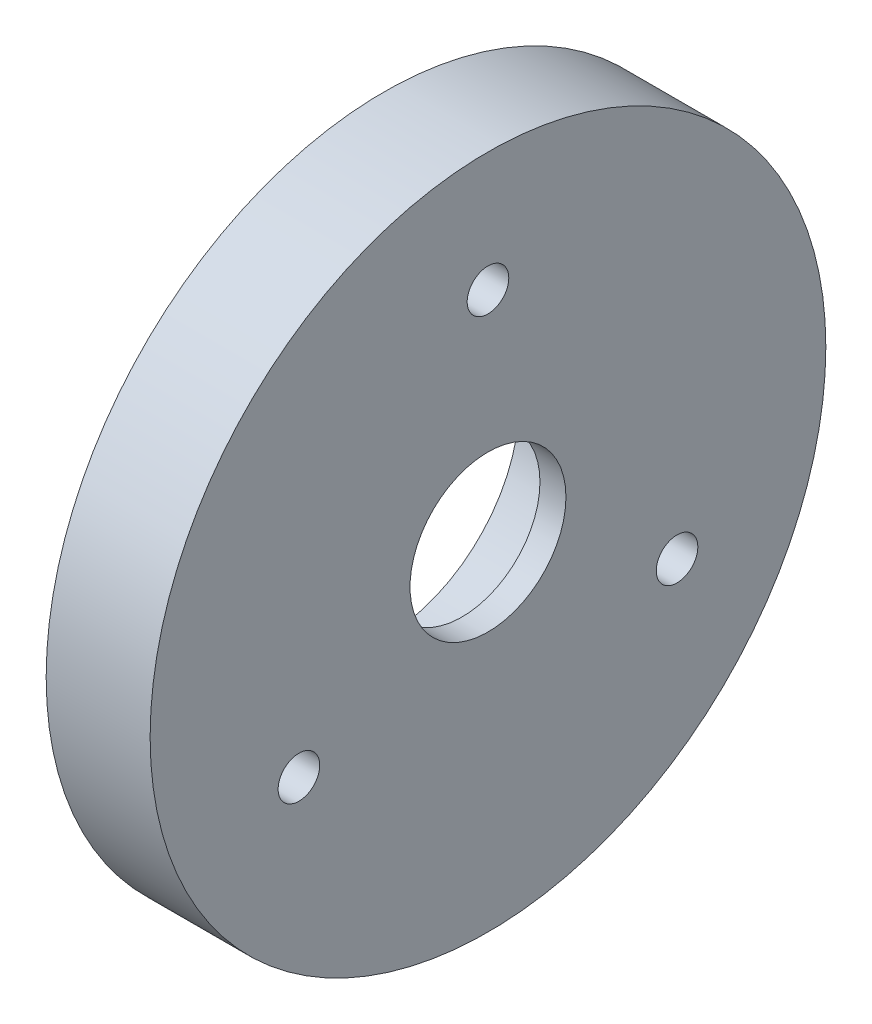
ISO-10303-21;
HEADER;
FILE_DESCRIPTION(('STEP AP214'),'2;1');
FILE_NAME('part.step','',(''),(''),'','','');
FILE_SCHEMA(('AUTOMOTIVE_DESIGN { 1 0 10303 214 1 1 1 1 }'));
ENDSEC;
DATA;
#1=APPLICATION_CONTEXT('core data for automotive mechanical design processes');
#2=APPLICATION_PROTOCOL_DEFINITION('international standard','automotive_design',2000,#1);
#3=PRODUCT_CONTEXT('',#1,'mechanical');
#4=PRODUCT('Part','Part','',(#3));
#5=PRODUCT_RELATED_PRODUCT_CATEGORY('part','',(#4));
#6=PRODUCT_DEFINITION_FORMATION('','',#4);
#7=PRODUCT_DEFINITION_CONTEXT('part definition',#1,'design');
#8=PRODUCT_DEFINITION('design','',#6,#7);
#9=PRODUCT_DEFINITION_SHAPE('','',#8);
#10=(LENGTH_UNIT() NAMED_UNIT(*) SI_UNIT(.MILLI.,.METRE.));
#11=(NAMED_UNIT(*) PLANE_ANGLE_UNIT() SI_UNIT($,.RADIAN.));
#12=(NAMED_UNIT(*) SI_UNIT($,.STERADIAN.) SOLID_ANGLE_UNIT());
#13=UNCERTAINTY_MEASURE_WITH_UNIT(LENGTH_MEASURE(1.E-05),#10,'distance_accuracy_value','');
#14=(GEOMETRIC_REPRESENTATION_CONTEXT(3) GLOBAL_UNCERTAINTY_ASSIGNED_CONTEXT((#13)) GLOBAL_UNIT_ASSIGNED_CONTEXT((#10,
#11,#12)) REPRESENTATION_CONTEXT('',''));
#15=CARTESIAN_POINT('',(0.,0.,0.));
#16=DIRECTION('',(0.,0.,1.));
#17=DIRECTION('',(1.,0.,0.));
#18=AXIS2_PLACEMENT_3D('',#15,#16,#17);
#19=CARTESIAN_POINT('',(20.,0.,0.));
#20=DIRECTION('',(-1.,0.,0.));
#21=DIRECTION('',(0.,0.,1.));
#22=AXIS2_PLACEMENT_3D('',#19,#20,#21);
#23=CYLINDRICAL_SURFACE('',#22,65.);
#24=CARTESIAN_POINT('',(20.,0.,0.));
#25=DIRECTION('',(1.,0.,0.));
#26=DIRECTION('',(0.,0.,-1.));
#27=AXIS2_PLACEMENT_3D('',#24,#25,#26);
#28=CIRCLE('',#27,65.);
#29=CARTESIAN_POINT('',(20.,0.,-65.));
#30=VERTEX_POINT('',#29);
#31=EDGE_CURVE('E10',#30,#30,#28,.T.);
#32=ORIENTED_EDGE('',*,*,#31,.F.);
#33=EDGE_LOOP('',(#32));
#34=FACE_BOUND('',#33,.T.);
#35=CARTESIAN_POINT('',(0.,0.,0.));
#36=DIRECTION('',(1.,0.,0.));
#37=DIRECTION('',(0.,0.,-1.));
#38=AXIS2_PLACEMENT_3D('',#35,#36,#37);
#39=CIRCLE('',#38,65.);
#40=CARTESIAN_POINT('',(0.,0.,-65.));
#41=VERTEX_POINT('',#40);
#42=EDGE_CURVE('E39',#41,#41,#39,.T.);
#43=ORIENTED_EDGE('',*,*,#42,.T.);
#44=EDGE_LOOP('',(#43));
#45=FACE_BOUND('',#44,.T.);
#46=ADVANCED_FACE('F32',(#34,#45),#23,.T.);
#47=CARTESIAN_POINT('',(20.,0.,0.));
#48=DIRECTION('',(1.,0.,0.));
#49=DIRECTION('',(0.,0.,-1.));
#50=AXIS2_PLACEMENT_3D('',#47,#48,#49);
#51=PLANE('',#50);
#52=CARTESIAN_POINT('',(20.,-21.0000000000002,36.3730669589463));
#53=DIRECTION('',(1.,0.,0.));
#54=DIRECTION('',(0.,0.866025403784436,0.500000000000004));
#55=AXIS2_PLACEMENT_3D('',#52,#53,#54);
#56=CIRCLE('',#55,4.);
#57=CARTESIAN_POINT('',(20.,-17.5358983848624,38.3730669589464));
#58=VERTEX_POINT('',#57);
#59=EDGE_CURVE('E64',#58,#58,#56,.F.);
#60=ORIENTED_EDGE('',*,*,#59,.T.);
#61=EDGE_LOOP('',(#60));
#62=FACE_BOUND('',#61,.T.);
#63=CARTESIAN_POINT('',(20.,-20.9999999999997,-36.3730669589466));
#64=DIRECTION('',(1.,0.,0.));
#65=DIRECTION('',(0.,-0.866025403784443,0.499999999999992));
#66=AXIS2_PLACEMENT_3D('',#63,#64,#65);
#67=CIRCLE('',#66,4.);
#68=CARTESIAN_POINT('',(20.,-24.4641016151374,-34.3730669589467));
#69=VERTEX_POINT('',#68);
#70=EDGE_CURVE('E65',#69,#69,#67,.F.);
#71=ORIENTED_EDGE('',*,*,#70,.T.);
#72=EDGE_LOOP('',(#71));
#73=FACE_BOUND('',#72,.T.);
#74=CARTESIAN_POINT('',(20.,42.,0.));
#75=DIRECTION('',(1.,0.,0.));
#76=DIRECTION('',(0.,0.,-1.));
#77=AXIS2_PLACEMENT_3D('',#74,#75,#76);
#78=CIRCLE('',#77,4.);
#79=CARTESIAN_POINT('',(20.,42.,-4.));
#80=VERTEX_POINT('',#79);
#81=EDGE_CURVE('E54',#80,#80,#78,.F.);
#82=ORIENTED_EDGE('',*,*,#81,.T.);
#83=EDGE_LOOP('',(#82));
#84=FACE_BOUND('',#83,.T.);
#85=CARTESIAN_POINT('',(20.,0.,0.));
#86=DIRECTION('',(1.,0.,0.));
#87=DIRECTION('',(0.,0.,-1.));
#88=AXIS2_PLACEMENT_3D('',#85,#86,#87);
#89=CIRCLE('',#88,15.);
#90=CARTESIAN_POINT('',(20.,0.,-15.));
#91=VERTEX_POINT('',#90);
#92=EDGE_CURVE('E51',#91,#91,#89,.T.);
#93=ORIENTED_EDGE('',*,*,#92,.F.);
#94=EDGE_LOOP('',(#93));
#95=FACE_BOUND('',#94,.T.);
#96=ORIENTED_EDGE('',*,*,#31,.T.);
#97=EDGE_LOOP('',(#96));
#98=FACE_BOUND('',#97,.T.);
#99=ADVANCED_FACE('F73',(#62,#73,#84,#95,#98),#51,.T.);
#100=CARTESIAN_POINT('',(0.,0.,0.));
#101=DIRECTION('',(1.,0.,0.));
#102=DIRECTION('',(0.,0.,-1.));
#103=AXIS2_PLACEMENT_3D('',#100,#101,#102);
#104=PLANE('',#103);
#105=CARTESIAN_POINT('',(0.,-21.0000000000002,36.3730669589463));
#106=DIRECTION('',(1.,0.,0.));
#107=DIRECTION('',(0.,0.866025403784436,0.500000000000004));
#108=AXIS2_PLACEMENT_3D('',#105,#106,#107);
#109=CIRCLE('',#108,4.);
#110=CARTESIAN_POINT('',(0.,-17.5358983848624,38.3730669589464));
#111=VERTEX_POINT('',#110);
#112=EDGE_CURVE('E60',#111,#111,#109,.F.);
#113=ORIENTED_EDGE('',*,*,#112,.F.);
#114=EDGE_LOOP('',(#113));
#115=FACE_BOUND('',#114,.T.);
#116=CARTESIAN_POINT('',(0.,-20.9999999999997,-36.3730669589466));
#117=DIRECTION('',(1.,0.,0.));
#118=DIRECTION('',(0.,-0.866025403784443,0.499999999999992));
#119=AXIS2_PLACEMENT_3D('',#116,#117,#118);
#120=CIRCLE('',#119,4.);
#121=CARTESIAN_POINT('',(0.,-24.4641016151374,-34.3730669589467));
#122=VERTEX_POINT('',#121);
#123=EDGE_CURVE('E61',#122,#122,#120,.F.);
#124=ORIENTED_EDGE('',*,*,#123,.F.);
#125=EDGE_LOOP('',(#124));
#126=FACE_BOUND('',#125,.T.);
#127=CARTESIAN_POINT('',(0.,42.,0.));
#128=DIRECTION('',(1.,0.,0.));
#129=DIRECTION('',(0.,0.,-1.));
#130=AXIS2_PLACEMENT_3D('',#127,#128,#129);
#131=CIRCLE('',#130,4.);
#132=CARTESIAN_POINT('',(0.,42.,-4.));
#133=VERTEX_POINT('',#132);
#134=EDGE_CURVE('E57',#133,#133,#131,.F.);
#135=ORIENTED_EDGE('',*,*,#134,.F.);
#136=EDGE_LOOP('',(#135));
#137=FACE_BOUND('',#136,.T.);
#138=CARTESIAN_POINT('',(0.,0.,0.));
#139=DIRECTION('',(1.,0.,0.));
#140=DIRECTION('',(0.,0.,-1.));
#141=AXIS2_PLACEMENT_3D('',#138,#139,#140);
#142=CIRCLE('',#141,26.);
#143=CARTESIAN_POINT('',(0.,0.,-26.));
#144=VERTEX_POINT('',#143);
#145=EDGE_CURVE('E46',#144,#144,#142,.T.);
#146=ORIENTED_EDGE('',*,*,#145,.T.);
#147=EDGE_LOOP('',(#146));
#148=FACE_BOUND('',#147,.T.);
#149=ORIENTED_EDGE('',*,*,#42,.F.);
#150=EDGE_LOOP('',(#149));
#151=FACE_BOUND('',#150,.T.);
#152=ADVANCED_FACE('F83',(#115,#126,#137,#148,#151),#104,.F.);
#153=CARTESIAN_POINT('',(15.,0.,0.));
#154=DIRECTION('',(-1.,0.,0.));
#155=DIRECTION('',(0.,0.,1.));
#156=AXIS2_PLACEMENT_3D('',#153,#154,#155);
#157=CYLINDRICAL_SURFACE('',#156,26.);
#158=CARTESIAN_POINT('',(15.,0.,0.));
#159=DIRECTION('',(1.,0.,0.));
#160=DIRECTION('',(0.,0.,-1.));
#161=AXIS2_PLACEMENT_3D('',#158,#159,#160);
#162=CIRCLE('',#161,26.);
#163=CARTESIAN_POINT('',(15.,0.,-26.));
#164=VERTEX_POINT('',#163);
#165=EDGE_CURVE('E44',#164,#164,#162,.T.);
#166=ORIENTED_EDGE('',*,*,#165,.T.);
#167=EDGE_LOOP('',(#166));
#168=FACE_BOUND('',#167,.T.);
#169=ORIENTED_EDGE('',*,*,#145,.F.);
#170=EDGE_LOOP('',(#169));
#171=FACE_BOUND('',#170,.T.);
#172=ADVANCED_FACE('F86',(#168,#171),#157,.F.);
#173=CARTESIAN_POINT('',(15.,0.,0.));
#174=DIRECTION('',(1.,0.,0.));
#175=DIRECTION('',(0.,0.,-1.));
#176=AXIS2_PLACEMENT_3D('',#173,#174,#175);
#177=PLANE('',#176);
#178=CARTESIAN_POINT('',(15.,0.,0.));
#179=DIRECTION('',(1.,0.,0.));
#180=DIRECTION('',(0.,0.,-1.));
#181=AXIS2_PLACEMENT_3D('',#178,#179,#180);
#182=CIRCLE('',#181,15.);
#183=CARTESIAN_POINT('',(15.,0.,-15.));
#184=VERTEX_POINT('',#183);
#185=EDGE_CURVE('E35',#184,#184,#182,.T.);
#186=ORIENTED_EDGE('',*,*,#185,.T.);
#187=EDGE_LOOP('',(#186));
#188=FACE_BOUND('',#187,.T.);
#189=ORIENTED_EDGE('',*,*,#165,.F.);
#190=EDGE_LOOP('',(#189));
#191=FACE_BOUND('',#190,.T.);
#192=ADVANCED_FACE('F106',(#188,#191),#177,.F.);
#193=CARTESIAN_POINT('',(0.,0.,0.));
#194=DIRECTION('',(1.,0.,0.));
#195=DIRECTION('',(0.,0.,-1.));
#196=AXIS2_PLACEMENT_3D('',#193,#194,#195);
#197=CYLINDRICAL_SURFACE('',#196,15.);
#198=ORIENTED_EDGE('',*,*,#92,.T.);
#199=EDGE_LOOP('',(#198));
#200=FACE_BOUND('',#199,.T.);
#201=ORIENTED_EDGE('',*,*,#185,.F.);
#202=EDGE_LOOP('',(#201));
#203=FACE_BOUND('',#202,.T.);
#204=ADVANCED_FACE('F110',(#200,#203),#197,.F.);
#205=CARTESIAN_POINT('',(20.000012,42.,0.));
#206=DIRECTION('',(-1.,0.,0.));
#207=DIRECTION('',(0.,0.,1.));
#208=AXIS2_PLACEMENT_3D('',#205,#206,#207);
#209=CYLINDRICAL_SURFACE('',#208,4.);
#210=ORIENTED_EDGE('',*,*,#81,.F.);
#211=EDGE_LOOP('',(#210));
#212=FACE_BOUND('',#211,.T.);
#213=ORIENTED_EDGE('',*,*,#134,.T.);
#214=EDGE_LOOP('',(#213));
#215=FACE_BOUND('',#214,.T.);
#216=ADVANCED_FACE('F114',(#212,#215),#209,.F.);
#217=CARTESIAN_POINT('',(20.000012,-20.9999999999997,-36.3730669589466));
#218=DIRECTION('',(-1.,0.,0.));
#219=DIRECTION('',(0.,0.866025403784443,-0.499999999999992));
#220=AXIS2_PLACEMENT_3D('',#217,#218,#219);
#221=CYLINDRICAL_SURFACE('',#220,4.);
#222=ORIENTED_EDGE('',*,*,#70,.F.);
#223=EDGE_LOOP('',(#222));
#224=FACE_BOUND('',#223,.T.);
#225=ORIENTED_EDGE('',*,*,#123,.T.);
#226=EDGE_LOOP('',(#225));
#227=FACE_BOUND('',#226,.T.);
#228=ADVANCED_FACE('F79',(#224,#227),#221,.F.);
#229=CARTESIAN_POINT('',(20.000012,-21.0000000000002,36.3730669589463));
#230=DIRECTION('',(-1.,0.,0.));
#231=DIRECTION('',(0.,-0.866025403784436,-0.500000000000004));
#232=AXIS2_PLACEMENT_3D('',#229,#230,#231);
#233=CYLINDRICAL_SURFACE('',#232,4.);
#234=ORIENTED_EDGE('',*,*,#59,.F.);
#235=EDGE_LOOP('',(#234));
#236=FACE_BOUND('',#235,.T.);
#237=ORIENTED_EDGE('',*,*,#112,.T.);
#238=EDGE_LOOP('',(#237));
#239=FACE_BOUND('',#238,.T.);
#240=ADVANCED_FACE('F76',(#236,#239),#233,.F.);
#241=CLOSED_SHELL('',(#46,#99,#152,#172,#192,#204,#216,#228,#240));
#242=MANIFOLD_SOLID_BREP('B2',#241);
#243=ADVANCED_BREP_SHAPE_REPRESENTATION('',(#18,#242),#14);
#244=SHAPE_DEFINITION_REPRESENTATION(#9,#243);
ENDSEC;
END-ISO-10303-21;
